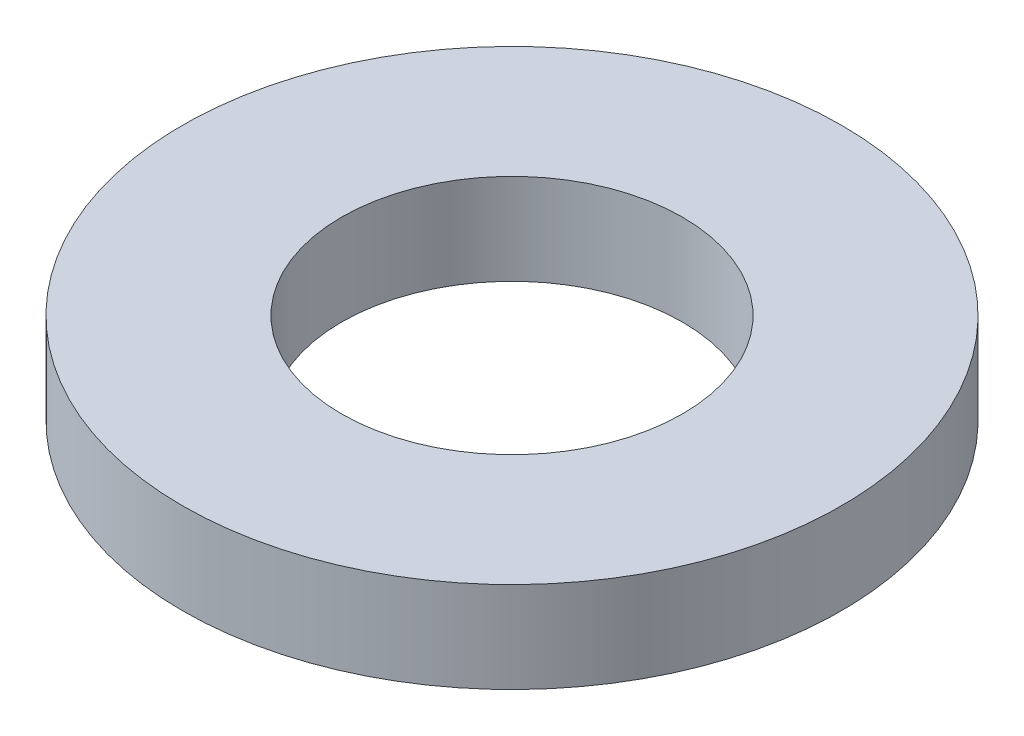
ISO-10303-21;
HEADER;
FILE_DESCRIPTION(('STEP AP214'),'2;1');
FILE_NAME('part.step','',(''),(''),'','','');
FILE_SCHEMA(('AUTOMOTIVE_DESIGN { 1 0 10303 214 1 1 1 1 }'));
ENDSEC;
DATA;
#1=APPLICATION_CONTEXT('core data for automotive mechanical design processes');
#2=APPLICATION_PROTOCOL_DEFINITION('international standard','automotive_design',2000,#1);
#3=PRODUCT_CONTEXT('',#1,'mechanical');
#4=PRODUCT('Part','Part','',(#3));
#5=PRODUCT_RELATED_PRODUCT_CATEGORY('part','',(#4));
#6=PRODUCT_DEFINITION_FORMATION('','',#4);
#7=PRODUCT_DEFINITION_CONTEXT('part definition',#1,'design');
#8=PRODUCT_DEFINITION('design','',#6,#7);
#9=PRODUCT_DEFINITION_SHAPE('','',#8);
#10=(LENGTH_UNIT() NAMED_UNIT(*) SI_UNIT(.MILLI.,.METRE.));
#11=(NAMED_UNIT(*) PLANE_ANGLE_UNIT() SI_UNIT($,.RADIAN.));
#12=(NAMED_UNIT(*) SI_UNIT($,.STERADIAN.) SOLID_ANGLE_UNIT());
#13=UNCERTAINTY_MEASURE_WITH_UNIT(LENGTH_MEASURE(1.E-05),#10,'distance_accuracy_value','');
#14=(GEOMETRIC_REPRESENTATION_CONTEXT(3) GLOBAL_UNCERTAINTY_ASSIGNED_CONTEXT((#13)) GLOBAL_UNIT_ASSIGNED_CONTEXT((#10,
#11,#12)) REPRESENTATION_CONTEXT('',''));
#15=CARTESIAN_POINT('',(0.,0.,0.));
#16=DIRECTION('',(0.,0.,1.));
#17=DIRECTION('',(1.,0.,0.));
#18=AXIS2_PLACEMENT_3D('',#15,#16,#17);
#19=CARTESIAN_POINT('',(0.,20.,0.));
#20=DIRECTION('',(0.,-1.,0.));
#21=DIRECTION('',(0.,0.,-1.));
#22=AXIS2_PLACEMENT_3D('',#19,#20,#21);
#23=CYLINDRICAL_SURFACE('',#22,72.5);
#24=CARTESIAN_POINT('',(0.,20.,0.));
#25=DIRECTION('',(0.,1.,0.));
#26=DIRECTION('',(0.,0.,1.));
#27=AXIS2_PLACEMENT_3D('',#24,#25,#26);
#28=CIRCLE('',#27,72.5);
#29=CARTESIAN_POINT('',(0.,20.,72.5));
#30=VERTEX_POINT('',#29);
#31=EDGE_CURVE('E10',#30,#30,#28,.T.);
#32=ORIENTED_EDGE('',*,*,#31,.F.);
#33=EDGE_LOOP('',(#32));
#34=FACE_BOUND('',#33,.T.);
#35=CARTESIAN_POINT('',(0.,0.,0.));
#36=DIRECTION('',(0.,1.,0.));
#37=DIRECTION('',(0.,0.,1.));
#38=AXIS2_PLACEMENT_3D('',#35,#36,#37);
#39=CIRCLE('',#38,72.5);
#40=CARTESIAN_POINT('',(0.,0.,72.5));
#41=VERTEX_POINT('',#40);
#42=EDGE_CURVE('E37',#41,#41,#39,.T.);
#43=ORIENTED_EDGE('',*,*,#42,.T.);
#44=EDGE_LOOP('',(#43));
#45=FACE_BOUND('',#44,.T.);
#46=ADVANCED_FACE('F40',(#34,#45),#23,.T.);
#47=CARTESIAN_POINT('',(0.,20.,0.));
#48=DIRECTION('',(0.,1.,0.));
#49=DIRECTION('',(0.,0.,1.));
#50=AXIS2_PLACEMENT_3D('',#47,#48,#49);
#51=PLANE('',#50);
#52=CARTESIAN_POINT('',(0.,20.,0.));
#53=DIRECTION('',(0.,1.,0.));
#54=DIRECTION('',(0.,0.,1.));
#55=AXIS2_PLACEMENT_3D('',#52,#53,#54);
#56=CIRCLE('',#55,37.5);
#57=CARTESIAN_POINT('',(0.,20.,37.5));
#58=VERTEX_POINT('',#57);
#59=EDGE_CURVE('E50',#58,#58,#56,.T.);
#60=ORIENTED_EDGE('',*,*,#59,.F.);
#61=EDGE_LOOP('',(#60));
#62=FACE_BOUND('',#61,.T.);
#63=ORIENTED_EDGE('',*,*,#31,.T.);
#64=EDGE_LOOP('',(#63));
#65=FACE_BOUND('',#64,.T.);
#66=ADVANCED_FACE('F59',(#62,#65),#51,.T.);
#67=CARTESIAN_POINT('',(0.,0.,0.));
#68=DIRECTION('',(0.,1.,0.));
#69=DIRECTION('',(0.,0.,1.));
#70=AXIS2_PLACEMENT_3D('',#67,#68,#69);
#71=PLANE('',#70);
#72=CARTESIAN_POINT('',(0.,0.,0.));
#73=DIRECTION('',(0.,1.,0.));
#74=DIRECTION('',(0.,0.,1.));
#75=AXIS2_PLACEMENT_3D('',#72,#73,#74);
#76=CIRCLE('',#75,37.5);
#77=CARTESIAN_POINT('',(0.,0.,37.5));
#78=VERTEX_POINT('',#77);
#79=EDGE_CURVE('E47',#78,#78,#76,.T.);
#80=ORIENTED_EDGE('',*,*,#79,.T.);
#81=EDGE_LOOP('',(#80));
#82=FACE_BOUND('',#81,.T.);
#83=ORIENTED_EDGE('',*,*,#42,.F.);
#84=EDGE_LOOP('',(#83));
#85=FACE_BOUND('',#84,.T.);
#86=ADVANCED_FACE('F58',(#82,#85),#71,.F.);
#87=CARTESIAN_POINT('',(0.,20.,0.));
#88=DIRECTION('',(0.,-1.,0.));
#89=DIRECTION('',(0.,0.,-1.));
#90=AXIS2_PLACEMENT_3D('',#87,#88,#89);
#91=CYLINDRICAL_SURFACE('',#90,37.5);
#92=ORIENTED_EDGE('',*,*,#59,.T.);
#93=EDGE_LOOP('',(#92));
#94=FACE_BOUND('',#93,.T.);
#95=ORIENTED_EDGE('',*,*,#79,.F.);
#96=EDGE_LOOP('',(#95));
#97=FACE_BOUND('',#96,.T.);
#98=ADVANCED_FACE('F54',(#94,#97),#91,.F.);
#99=CLOSED_SHELL('',(#46,#66,#86,#98));
#100=MANIFOLD_SOLID_BREP('B2',#99);
#101=ADVANCED_BREP_SHAPE_REPRESENTATION('',(#18,#100),#14);
#102=SHAPE_DEFINITION_REPRESENTATION(#9,#101);
ENDSEC;
END-ISO-10303-21;
